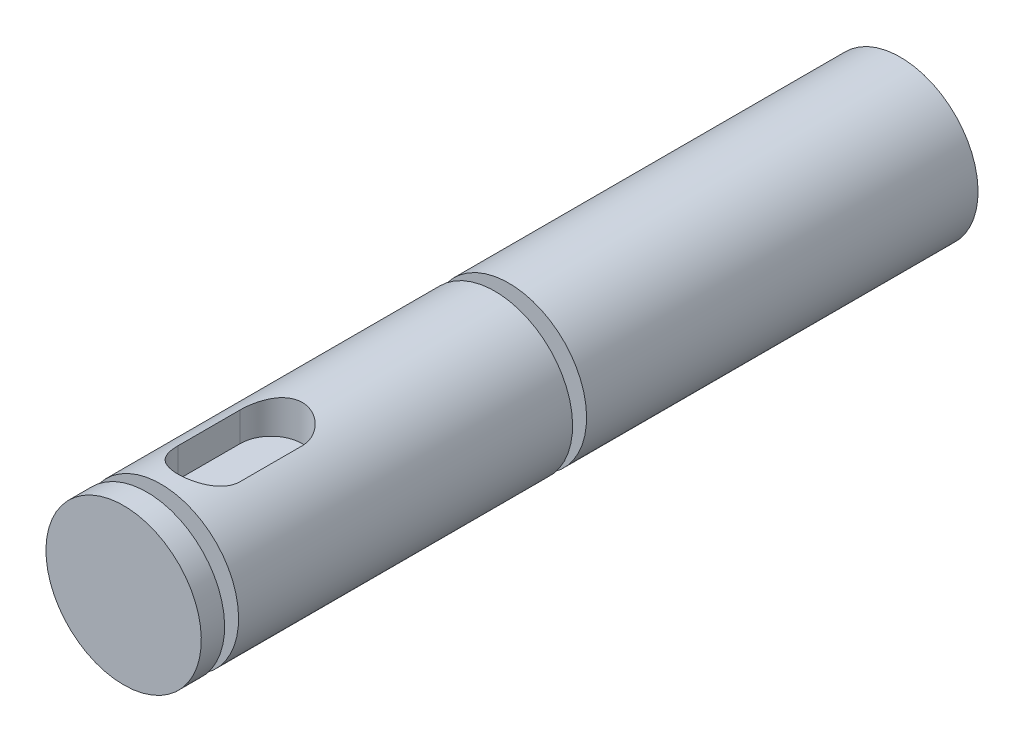
ISO-10303-21;
HEADER;
FILE_DESCRIPTION(('STEP AP214'),'2;1');
FILE_NAME('part.step','',(''),(''),'','','');
FILE_SCHEMA(('AUTOMOTIVE_DESIGN { 1 0 10303 214 1 1 1 1 }'));
ENDSEC;
DATA;
#1=APPLICATION_CONTEXT('core data for automotive mechanical design processes');
#2=APPLICATION_PROTOCOL_DEFINITION('international standard','automotive_design',2000,#1);
#3=PRODUCT_CONTEXT('',#1,'mechanical');
#4=PRODUCT('Part','Part','',(#3));
#5=PRODUCT_RELATED_PRODUCT_CATEGORY('part','',(#4));
#6=PRODUCT_DEFINITION_FORMATION('','',#4);
#7=PRODUCT_DEFINITION_CONTEXT('part definition',#1,'design');
#8=PRODUCT_DEFINITION('design','',#6,#7);
#9=PRODUCT_DEFINITION_SHAPE('','',#8);
#10=(LENGTH_UNIT() NAMED_UNIT(*) SI_UNIT(.MILLI.,.METRE.));
#11=(NAMED_UNIT(*) PLANE_ANGLE_UNIT() SI_UNIT($,.RADIAN.));
#12=(NAMED_UNIT(*) SI_UNIT($,.STERADIAN.) SOLID_ANGLE_UNIT());
#13=UNCERTAINTY_MEASURE_WITH_UNIT(LENGTH_MEASURE(1.E-05),#10,'distance_accuracy_value','');
#14=(GEOMETRIC_REPRESENTATION_CONTEXT(3) GLOBAL_UNCERTAINTY_ASSIGNED_CONTEXT((#13)) GLOBAL_UNIT_ASSIGNED_CONTEXT((#10,
#11,#12)) REPRESENTATION_CONTEXT('',''));
#15=CARTESIAN_POINT('',(0.,0.,0.));
#16=DIRECTION('',(0.,0.,1.));
#17=DIRECTION('',(1.,0.,0.));
#18=AXIS2_PLACEMENT_3D('',#15,#16,#17);
#19=CARTESIAN_POINT('',(0.,0.,0.));
#20=DIRECTION('',(0.,0.,1.));
#21=DIRECTION('',(0.,-1.,0.));
#22=AXIS2_PLACEMENT_3D('',#19,#20,#21);
#23=PLANE('',#22);
#24=CARTESIAN_POINT('',(0.,0.,0.));
#25=DIRECTION('',(0.,0.,1.));
#26=DIRECTION('',(0.,-1.,0.));
#27=AXIS2_PLACEMENT_3D('',#24,#25,#26);
#28=CIRCLE('',#27,5.00000000000002);
#29=CARTESIAN_POINT('',(0.,-5.00000000000002,0.));
#30=VERTEX_POINT('',#29);
#31=EDGE_CURVE('E20',#30,#30,#28,.F.);
#32=ORIENTED_EDGE('',*,*,#31,.F.);
#33=EDGE_LOOP('',(#32));
#34=FACE_BOUND('',#33,.T.);
#35=ADVANCED_FACE('F17',(#34),#23,.T.);
#36=CARTESIAN_POINT('',(0.,0.,-0.750000000000002));
#37=DIRECTION('',(0.,0.,1.));
#38=DIRECTION('',(0.,-1.,0.));
#39=AXIS2_PLACEMENT_3D('',#36,#37,#38);
#40=CYLINDRICAL_SURFACE('',#39,5.00000000000002);
#41=CARTESIAN_POINT('',(0.,0.,-1.50000000000001));
#42=DIRECTION('',(0.,0.,1.));
#43=DIRECTION('',(0.,-1.,0.));
#44=AXIS2_PLACEMENT_3D('',#41,#42,#43);
#45=CIRCLE('',#44,5.00000000000002);
#46=CARTESIAN_POINT('',(0.,-5.00000000000002,-1.50000000000001));
#47=VERTEX_POINT('',#46);
#48=EDGE_CURVE('E172',#47,#47,#45,.F.);
#49=ORIENTED_EDGE('',*,*,#48,.F.);
#50=EDGE_LOOP('',(#49));
#51=FACE_BOUND('',#50,.T.);
#52=ORIENTED_EDGE('',*,*,#31,.T.);
#53=EDGE_LOOP('',(#52));
#54=FACE_BOUND('',#53,.T.);
#55=ADVANCED_FACE('F179',(#51,#54),#40,.T.);
#56=CARTESIAN_POINT('',(0.,5.00000000000001,-1.5));
#57=DIRECTION('',(0.,0.,-1.));
#58=DIRECTION('',(0.,1.,0.));
#59=AXIS2_PLACEMENT_3D('',#56,#57,#58);
#60=PLANE('',#59);
#61=CARTESIAN_POINT('',(0.,0.,-1.50000000000001));
#62=DIRECTION('',(0.,0.,1.));
#63=DIRECTION('',(0.,-1.,0.));
#64=AXIS2_PLACEMENT_3D('',#61,#62,#63);
#65=CIRCLE('',#64,3.55000000000002);
#66=CARTESIAN_POINT('',(0.,-3.55000000000002,-1.50000000000001));
#67=VERTEX_POINT('',#66);
#68=EDGE_CURVE('E170',#67,#67,#65,.F.);
#69=ORIENTED_EDGE('',*,*,#68,.F.);
#70=EDGE_LOOP('',(#69));
#71=FACE_BOUND('',#70,.T.);
#72=ORIENTED_EDGE('',*,*,#48,.T.);
#73=EDGE_LOOP('',(#72));
#74=FACE_BOUND('',#73,.T.);
#75=ADVANCED_FACE('F185',(#71,#74),#60,.T.);
#76=CARTESIAN_POINT('',(0.,0.,-1.95));
#77=DIRECTION('',(0.,0.,1.));
#78=DIRECTION('',(0.,-1.,0.));
#79=AXIS2_PLACEMENT_3D('',#76,#77,#78);
#80=CYLINDRICAL_SURFACE('',#79,3.55000000000002);
#81=CARTESIAN_POINT('',(0.,0.,-2.4));
#82=DIRECTION('',(0.,0.,1.));
#83=DIRECTION('',(0.,-1.,0.));
#84=AXIS2_PLACEMENT_3D('',#81,#82,#83);
#85=CIRCLE('',#84,3.55000000000002);
#86=CARTESIAN_POINT('',(0.,-3.55000000000002,-2.4));
#87=VERTEX_POINT('',#86);
#88=EDGE_CURVE('E73',#87,#87,#85,.F.);
#89=ORIENTED_EDGE('',*,*,#88,.F.);
#90=EDGE_LOOP('',(#89));
#91=FACE_BOUND('',#90,.T.);
#92=ORIENTED_EDGE('',*,*,#68,.T.);
#93=EDGE_LOOP('',(#92));
#94=FACE_BOUND('',#93,.T.);
#95=ADVANCED_FACE('F190',(#91,#94),#80,.T.);
#96=CARTESIAN_POINT('',(0.,2.7,-7.5));
#97=DIRECTION('',(0.,1.,0.));
#98=DIRECTION('',(0.,0.,1.));
#99=AXIS2_PLACEMENT_3D('',#96,#97,#98);
#100=PLANE('',#99);
#101=CARTESIAN_POINT('',(0.,2.7,-5.5));
#102=DIRECTION('',(0.,-1.,0.));
#103=DIRECTION('',(0.,0.,-1.));
#104=AXIS2_PLACEMENT_3D('',#101,#102,#103);
#105=CIRCLE('',#104,2.);
#106=CARTESIAN_POINT('',(-2.,2.7,-5.5));
#107=VERTEX_POINT('',#106);
#108=CARTESIAN_POINT('',(2.,2.7,-5.5));
#109=VERTEX_POINT('',#108);
#110=EDGE_CURVE('E59',#107,#109,#105,.F.);
#111=ORIENTED_EDGE('',*,*,#110,.T.);
#112=DIRECTION('',(0.,0.,-1.));
#113=VECTOR('',#112,1.);
#114=CARTESIAN_POINT('',(2.,2.7,-9.5));
#115=LINE('',#114,#113);
#116=CARTESIAN_POINT('',(2.,2.7,-9.5));
#117=VERTEX_POINT('',#116);
#118=EDGE_CURVE('E85',#109,#117,#115,.T.);
#119=ORIENTED_EDGE('',*,*,#118,.T.);
#120=CARTESIAN_POINT('',(0.,2.7,-9.5));
#121=DIRECTION('',(0.,-1.,0.));
#122=DIRECTION('',(0.,0.,-1.));
#123=AXIS2_PLACEMENT_3D('',#120,#121,#122);
#124=CIRCLE('',#123,2.);
#125=CARTESIAN_POINT('',(-2.,2.7,-9.5));
#126=VERTEX_POINT('',#125);
#127=EDGE_CURVE('E61',#117,#126,#124,.F.);
#128=ORIENTED_EDGE('',*,*,#127,.T.);
#129=DIRECTION('',(0.,0.,1.));
#130=VECTOR('',#129,1.);
#131=CARTESIAN_POINT('',(-2.,2.7,-5.5));
#132=LINE('',#131,#130);
#133=EDGE_CURVE('E56',#126,#107,#132,.T.);
#134=ORIENTED_EDGE('',*,*,#133,.T.);
#135=EDGE_LOOP('',(#111,#119,#128,#134));
#136=FACE_BOUND('',#135,.T.);
#137=ADVANCED_FACE('F58',(#136),#100,.T.);
#138=CARTESIAN_POINT('',(0.,3.55000000000002,-2.4));
#139=DIRECTION('',(0.,0.,1.));
#140=DIRECTION('',(0.,-1.,0.));
#141=AXIS2_PLACEMENT_3D('',#138,#139,#140);
#142=PLANE('',#141);
#143=ORIENTED_EDGE('',*,*,#88,.T.);
#144=EDGE_LOOP('',(#143));
#145=FACE_BOUND('',#144,.T.);
#146=CARTESIAN_POINT('',(0.,0.,-2.4));
#147=DIRECTION('',(0.,0.,1.));
#148=DIRECTION('',(0.,-1.,0.));
#149=AXIS2_PLACEMENT_3D('',#146,#147,#148);
#150=CIRCLE('',#149,5.);
#151=CARTESIAN_POINT('',(0.,-5.,-2.4));
#152=VERTEX_POINT('',#151);
#153=EDGE_CURVE('E164',#152,#152,#150,.F.);
#154=ORIENTED_EDGE('',*,*,#153,.F.);
#155=EDGE_LOOP('',(#154));
#156=FACE_BOUND('',#155,.T.);
#157=ADVANCED_FACE('F199',(#145,#156),#142,.T.);
#158=CARTESIAN_POINT('',(0.,5.,-5.5));
#159=DIRECTION('',(0.,-1.,0.));
#160=DIRECTION('',(0.,0.,-1.));
#161=AXIS2_PLACEMENT_3D('',#158,#159,#160);
#162=CYLINDRICAL_SURFACE('',#161,2.);
#163=DIRECTION('',(0.,1.,0.));
#164=VECTOR('',#163,1.);
#165=CARTESIAN_POINT('',(2.,5.,-5.5));
#166=LINE('',#165,#164);
#167=CARTESIAN_POINT('',(2.,4.58257569495584,-5.5));
#168=VERTEX_POINT('',#167);
#169=EDGE_CURVE('E71',#168,#109,#166,.F.);
#170=ORIENTED_EDGE('',*,*,#169,.T.);
#171=ORIENTED_EDGE('',*,*,#110,.F.);
#172=DIRECTION('',(0.,1.,0.));
#173=VECTOR('',#172,1.);
#174=CARTESIAN_POINT('',(-2.,5.,-5.5));
#175=LINE('',#174,#173);
#176=CARTESIAN_POINT('',(-2.,4.58257569495584,-5.5));
#177=VERTEX_POINT('',#176);
#178=EDGE_CURVE('E65',#107,#177,#175,.T.);
#179=ORIENTED_EDGE('',*,*,#178,.T.);
#180=CARTESIAN_POINT('',(2.,4.58257569495584,-5.5));
#181=CARTESIAN_POINT('',(2.00000798036347,4.58256464470382,-5.44619414749741));
#182=CARTESIAN_POINT('',(1.99782891366025,4.58352306077323,-5.39239433444235));
#183=CARTESIAN_POINT('',(1.98915905973447,4.58729625417544,-5.2852287017453));
#184=CARTESIAN_POINT('',(1.98266991468793,4.59011032448545,-5.23186272464397));
#185=CARTESIAN_POINT('',(1.9654760367637,4.5974978292064,-5.12615317844121));
#186=CARTESIAN_POINT('',(1.95478796820434,4.60206430717533,-5.07380641595597));
#187=CARTESIAN_POINT('',(1.9293163019066,4.61280053296682,-4.97029922828554));
#188=CARTESIAN_POINT('',(1.9145324541709,4.61897037865399,-4.91913887572283));
#189=CARTESIAN_POINT('',(1.86426971793523,4.63959291248422,-4.76806414941803));
#190=CARTESIAN_POINT('',(1.82284489460008,4.65617449157431,-4.67034576931025));
#191=CARTESIAN_POINT('',(1.72548191592176,4.6931237076538,-4.48320441991737));
#192=CARTESIAN_POINT('',(1.66952996336925,4.71349493864007,-4.39378944703834));
#193=CARTESIAN_POINT('',(1.54131835736854,4.75700999402115,-4.22073760332578));
#194=CARTESIAN_POINT('',(1.4683691399273,4.78024245635517,-4.13763278307977));
#195=CARTESIAN_POINT('',(1.30969646176209,4.82612790548656,-3.98445972778927));
#196=CARTESIAN_POINT('',(1.22397038499682,4.84878077249721,-3.91439416913425));
#197=CARTESIAN_POINT('',(1.03800590808969,4.89203417106082,-3.78659360580435));
#198=CARTESIAN_POINT('',(0.937327933050961,4.91251824543531,-3.72945519073807));
#199=CARTESIAN_POINT('',(0.72682414324671,4.94803944125004,-3.63315592731135));
#200=CARTESIAN_POINT('',(0.617002169026244,4.96307883544185,-3.59398757594832));
#201=CARTESIAN_POINT('',(0.396967441295691,4.98538314653816,-3.53665879868942));
#202=CARTESIAN_POINT('',(0.287031054523059,4.99298922547927,-3.51757304909434));
#203=CARTESIAN_POINT('',(0.0652684304565152,5.00080310201086,-3.49797152005438));
#204=CARTESIAN_POINT('',(-0.0465571232841652,5.0010135205303,-3.49744916197646));
#205=CARTESIAN_POINT('',(-0.262233376226784,4.99421960045302,-3.51448283915986));
#206=CARTESIAN_POINT('',(-0.366179202506791,4.98761985585461,-3.531025046674));
#207=CARTESIAN_POINT('',(-0.569674786500929,4.96849270441446,-3.57999342705353));
#208=CARTESIAN_POINT('',(-0.669224295072842,4.95596496209929,-3.61242049886861));
#209=CARTESIAN_POINT('',(-0.862897539070295,4.92596830598785,-3.69263629642451));
#210=CARTESIAN_POINT('',(-0.95691685136644,4.90842774755848,-3.74064924081046));
#211=CARTESIAN_POINT('',(-1.13580746919776,4.87014602008043,-3.85046458859515));
#212=CARTESIAN_POINT('',(-1.22067554984698,4.84940372896449,-3.91227182969058));
#213=CARTESIAN_POINT('',(-1.38476339273627,4.80521782746144,-4.05264418025852));
#214=CARTESIAN_POINT('',(-1.4632477030894,4.78168627172885,-4.13204247467003));
#215=CARTESIAN_POINT('',(-1.60609926099478,4.7356195058465,-4.30298009514766));
#216=CARTESIAN_POINT('',(-1.67046007709005,4.71308475332783,-4.39452492209426));
#217=CARTESIAN_POINT('',(-1.78493657933605,4.67095688856025,-4.59047028402121));
#218=CARTESIAN_POINT('',(-1.83458932217622,4.65146702150583,-4.69516483666021));
#219=CARTESIAN_POINT('',(-1.91521298357264,4.61886105059582,-4.91236152442947));
#220=CARTESIAN_POINT('',(-1.94621696002208,4.60573367628738,-5.02484944733829));
#221=CARTESIAN_POINT('',(-1.9781058182572,4.59208303529493,-5.19874363415798));
#222=CARTESIAN_POINT('',(-1.98630505165979,4.58853437680527,-5.25865754930133));
#223=CARTESIAN_POINT('',(-1.99725282103812,4.58377540314389,-5.37903501899554));
#224=CARTESIAN_POINT('',(-2.00000471568568,4.58256364711745,-5.43949821175783));
#225=CARTESIAN_POINT('',(-2.,4.58257569495584,-5.5));
#226=B_SPLINE_CURVE_WITH_KNOTS('',3,(#180,#181,#182,#183,#184,#185,#186,#187,#188,#189,#190,
#191,#192,#193,#194,#195,#196,#197,#198,#199,#200,#201,#202,#203,#204,#205,#206,#207,#208,#209,
#210,#211,#212,#213,#214,#215,#216,#217,#218,#219,#220,#221,#222,#223,#224,#225),.UNSPECIFIED.,
.F.,.F.,(4,2,2,2,2,2,2,2,2,2,2,2,2,2,2,2,2,2,2,2,2,2,4),(0.,0.161354853098824,0.322648263883208,
0.483307911251882,0.643977367092306,0.964683001739095,1.28569434942626,1.62318047995498,
1.96073580539191,2.31162858925764,2.66237473197323,2.9961387650427,3.32978451514656,
3.64468915259535,3.95961161305654,4.27928176927547,4.59906421133019,4.93981874675153,
5.28072813203934,5.63144241548462,5.98153315592125,6.16300192557813,6.3443587719356),.UNSPECIFIED.);
#227=EDGE_CURVE('E107',#168,#177,#226,.T.);
#228=ORIENTED_EDGE('',*,*,#227,.F.);
#229=EDGE_LOOP('',(#170,#171,#179,#228));
#230=FACE_BOUND('',#229,.T.);
#231=ADVANCED_FACE('F68',(#230),#162,.F.);
#232=CARTESIAN_POINT('',(-2.,5.,-5.5));
#233=DIRECTION('',(-1.,0.,0.));
#234=DIRECTION('',(0.,0.,1.));
#235=AXIS2_PLACEMENT_3D('',#232,#233,#234);
#236=PLANE('',#235);
#237=ORIENTED_EDGE('',*,*,#178,.F.);
#238=ORIENTED_EDGE('',*,*,#133,.F.);
#239=DIRECTION('',(0.,-1.,0.));
#240=VECTOR('',#239,1.);
#241=CARTESIAN_POINT('',(-2.,5.,-9.5));
#242=LINE('',#241,#240);
#243=CARTESIAN_POINT('',(-2.,4.58257569495585,-9.5));
#244=VERTEX_POINT('',#243);
#245=EDGE_CURVE('E80',#126,#244,#242,.F.);
#246=ORIENTED_EDGE('',*,*,#245,.T.);
#247=DIRECTION('',(0.,0.,1.));
#248=VECTOR('',#247,1.);
#249=CARTESIAN_POINT('',(-2.,4.58257569495585,-13.15));
#250=LINE('',#249,#248);
#251=EDGE_CURVE('E77',#177,#244,#250,.F.);
#252=ORIENTED_EDGE('',*,*,#251,.F.);
#253=EDGE_LOOP('',(#237,#238,#246,#252));
#254=FACE_BOUND('',#253,.T.);
#255=ADVANCED_FACE('F75',(#254),#236,.F.);
#256=CARTESIAN_POINT('',(0.,5.,-9.5));
#257=DIRECTION('',(0.,-1.,0.));
#258=DIRECTION('',(0.,0.,-1.));
#259=AXIS2_PLACEMENT_3D('',#256,#257,#258);
#260=CYLINDRICAL_SURFACE('',#259,2.);
#261=ORIENTED_EDGE('',*,*,#245,.F.);
#262=ORIENTED_EDGE('',*,*,#127,.F.);
#263=DIRECTION('',(0.,1.,0.));
#264=VECTOR('',#263,1.);
#265=CARTESIAN_POINT('',(2.,5.,-9.5));
#266=LINE('',#265,#264);
#267=CARTESIAN_POINT('',(2.,4.58257569495585,-9.5));
#268=VERTEX_POINT('',#267);
#269=EDGE_CURVE('E35',#117,#268,#266,.T.);
#270=ORIENTED_EDGE('',*,*,#269,.T.);
#271=CARTESIAN_POINT('',(-2.,4.58257569495585,-9.5));
#272=CARTESIAN_POINT('',(-2.00000798036347,4.58256464470382,-9.55380585250259));
#273=CARTESIAN_POINT('',(-1.99782891366025,4.58352306077323,-9.60760566555765));
#274=CARTESIAN_POINT('',(-1.98915905973447,4.58729625417544,-9.7147712982547));
#275=CARTESIAN_POINT('',(-1.98266991468793,4.59011032448546,-9.76813727535603));
#276=CARTESIAN_POINT('',(-1.9654760367637,4.5974978292064,-9.87384682155879));
#277=CARTESIAN_POINT('',(-1.95478796820434,4.60206430717533,-9.92619358404403));
#278=CARTESIAN_POINT('',(-1.9293163019066,4.61280053296683,-10.0297007717145));
#279=CARTESIAN_POINT('',(-1.9145324541709,4.61897037865399,-10.0808611242772));
#280=CARTESIAN_POINT('',(-1.86426971793523,4.63959291248422,-10.231935850582));
#281=CARTESIAN_POINT('',(-1.82284489460008,4.65617449157431,-10.3296542306897));
#282=CARTESIAN_POINT('',(-1.72548191592176,4.69312370765381,-10.5167955800826));
#283=CARTESIAN_POINT('',(-1.66952996336925,4.71349493864008,-10.6062105529617));
#284=CARTESIAN_POINT('',(-1.54131835736854,4.75700999402115,-10.7792623966742));
#285=CARTESIAN_POINT('',(-1.4683691399273,4.78024245635517,-10.8623672169202));
#286=CARTESIAN_POINT('',(-1.30969646176209,4.82612790548656,-11.0155402722107));
#287=CARTESIAN_POINT('',(-1.22397038499682,4.84878077249722,-11.0856058308657));
#288=CARTESIAN_POINT('',(-1.03800590808969,4.89203417106083,-11.2134063941957));
#289=CARTESIAN_POINT('',(-0.937327933050961,4.91251824543532,-11.2705448092619));
#290=CARTESIAN_POINT('',(-0.726824143246709,4.94803944125005,-11.3668440726886));
#291=CARTESIAN_POINT('',(-0.617002169026243,4.96307883544186,-11.4060124240517));
#292=CARTESIAN_POINT('',(-0.39696744129569,4.98538314653816,-11.4633412013106));
#293=CARTESIAN_POINT('',(-0.287031054523058,4.99298922547928,-11.4824269509057));
#294=CARTESIAN_POINT('',(-0.0652684304565142,5.00080310201086,-11.5020284799456));
#295=CARTESIAN_POINT('',(0.0465571232841663,5.0010135205303,-11.5025508380235));
#296=CARTESIAN_POINT('',(0.262233376226785,4.99421960045303,-11.4855171608401));
#297=CARTESIAN_POINT('',(0.366179202506792,4.98761985585462,-11.468974953326));
#298=CARTESIAN_POINT('',(0.56967478650093,4.96849270441447,-11.4200065729465));
#299=CARTESIAN_POINT('',(0.669224295072843,4.9559649620993,-11.3875795011314));
#300=CARTESIAN_POINT('',(0.862897539070296,4.92596830598786,-11.3073637035755));
#301=CARTESIAN_POINT('',(0.95691685136644,4.90842774755849,-11.2593507591895));
#302=CARTESIAN_POINT('',(1.13580746919776,4.87014602008044,-11.1495354114048));
#303=CARTESIAN_POINT('',(1.22067554984698,4.84940372896449,-11.0877281703094));
#304=CARTESIAN_POINT('',(1.38476339273627,4.80521782746144,-10.9473558197415));
#305=CARTESIAN_POINT('',(1.4632477030894,4.78168627172885,-10.86795752533));
#306=CARTESIAN_POINT('',(1.60609926099478,4.73561950584651,-10.6970199048523));
#307=CARTESIAN_POINT('',(1.67046007709005,4.71308475332784,-10.6054750779057));
#308=CARTESIAN_POINT('',(1.78493657933605,4.67095688856025,-10.4095297159788));
#309=CARTESIAN_POINT('',(1.83458932217622,4.65146702150584,-10.3048351633398));
#310=CARTESIAN_POINT('',(1.91521298357264,4.61886105059582,-10.0876384755705));
#311=CARTESIAN_POINT('',(1.94621696002208,4.60573367628738,-9.9751505526617));
#312=CARTESIAN_POINT('',(1.9781058182572,4.59208303529493,-9.80125636584202));
#313=CARTESIAN_POINT('',(1.98630505165979,4.58853437680527,-9.74134245069867));
#314=CARTESIAN_POINT('',(1.99725282103812,4.58377540314389,-9.62096498100446));
#315=CARTESIAN_POINT('',(2.00000471568568,4.58256364711745,-9.56050178824217));
#316=CARTESIAN_POINT('',(2.,4.58257569495585,-9.5));
#317=B_SPLINE_CURVE_WITH_KNOTS('',3,(#271,#272,#273,#274,#275,#276,#277,#278,#279,#280,#281,
#282,#283,#284,#285,#286,#287,#288,#289,#290,#291,#292,#293,#294,#295,#296,#297,#298,#299,#300,
#301,#302,#303,#304,#305,#306,#307,#308,#309,#310,#311,#312,#313,#314,#315,#316),.UNSPECIFIED.,
.F.,.F.,(4,2,2,2,2,2,2,2,2,2,2,2,2,2,2,2,2,2,2,2,2,2,4),(0.,0.161354853098824,0.322648263883208,
0.483307911251882,0.643977367092306,0.964683001739093,1.28569434942626,1.62318047995498,
1.96073580539191,2.31162858925764,2.66237473197323,2.9961387650427,3.32978451514656,
3.64468915259535,3.95961161305654,4.27928176927547,4.59906421133019,4.93981874675153,
5.28072813203934,5.63144241548462,5.98153315592125,6.16300192557814,6.34435877193561),.UNSPECIFIED.);
#318=EDGE_CURVE('E99',#244,#268,#317,.T.);
#319=ORIENTED_EDGE('',*,*,#318,.F.);
#320=EDGE_LOOP('',(#261,#262,#270,#319));
#321=FACE_BOUND('',#320,.T.);
#322=ADVANCED_FACE('F113',(#321),#260,.F.);
#323=CARTESIAN_POINT('',(2.,5.,-9.5));
#324=DIRECTION('',(1.,0.,0.));
#325=DIRECTION('',(0.,0.,-1.));
#326=AXIS2_PLACEMENT_3D('',#323,#324,#325);
#327=PLANE('',#326);
#328=ORIENTED_EDGE('',*,*,#269,.F.);
#329=ORIENTED_EDGE('',*,*,#118,.F.);
#330=ORIENTED_EDGE('',*,*,#169,.F.);
#331=DIRECTION('',(0.,0.,1.));
#332=VECTOR('',#331,1.);
#333=CARTESIAN_POINT('',(2.,4.58257569495585,-13.15));
#334=LINE('',#333,#332);
#335=EDGE_CURVE('E98',#268,#168,#334,.T.);
#336=ORIENTED_EDGE('',*,*,#335,.F.);
#337=EDGE_LOOP('',(#328,#329,#330,#336));
#338=FACE_BOUND('',#337,.T.);
#339=ADVANCED_FACE('F122',(#338),#327,.F.);
#340=CARTESIAN_POINT('',(0.,0.,-13.15));
#341=DIRECTION('',(0.,0.,1.));
#342=DIRECTION('',(0.,-1.,0.));
#343=AXIS2_PLACEMENT_3D('',#340,#341,#342);
#344=CYLINDRICAL_SURFACE('',#343,5.);
#345=CARTESIAN_POINT('',(0.,0.,-23.9));
#346=DIRECTION('',(0.,0.,1.));
#347=DIRECTION('',(0.,-1.,0.));
#348=AXIS2_PLACEMENT_3D('',#345,#346,#347);
#349=CIRCLE('',#348,5.);
#350=CARTESIAN_POINT('',(0.,-4.99999999999998,-23.9));
#351=VERTEX_POINT('',#350);
#352=EDGE_CURVE('E95',#351,#351,#349,.F.);
#353=ORIENTED_EDGE('',*,*,#352,.F.);
#354=EDGE_LOOP('',(#353));
#355=FACE_BOUND('',#354,.T.);
#356=ORIENTED_EDGE('',*,*,#318,.T.);
#357=ORIENTED_EDGE('',*,*,#335,.T.);
#358=ORIENTED_EDGE('',*,*,#227,.T.);
#359=ORIENTED_EDGE('',*,*,#251,.T.);
#360=EDGE_LOOP('',(#356,#357,#358,#359));
#361=FACE_BOUND('',#360,.T.);
#362=ORIENTED_EDGE('',*,*,#153,.T.);
#363=EDGE_LOOP('',(#362));
#364=FACE_BOUND('',#363,.T.);
#365=ADVANCED_FACE('F117',(#355,#361,#364),#344,.T.);
#366=CARTESIAN_POINT('',(0.,5.00000000000002,-23.9));
#367=DIRECTION('',(0.,0.,-1.));
#368=DIRECTION('',(0.,1.,0.));
#369=AXIS2_PLACEMENT_3D('',#366,#367,#368);
#370=PLANE('',#369);
#371=CARTESIAN_POINT('',(0.,0.,-23.9));
#372=DIRECTION('',(0.,0.,1.));
#373=DIRECTION('',(0.,-1.,0.));
#374=AXIS2_PLACEMENT_3D('',#371,#372,#373);
#375=CIRCLE('',#374,3.55000000000001);
#376=CARTESIAN_POINT('',(0.,-3.54999999999999,-23.9));
#377=VERTEX_POINT('',#376);
#378=EDGE_CURVE('E92',#377,#377,#375,.F.);
#379=ORIENTED_EDGE('',*,*,#378,.F.);
#380=EDGE_LOOP('',(#379));
#381=FACE_BOUND('',#380,.T.);
#382=ORIENTED_EDGE('',*,*,#352,.T.);
#383=EDGE_LOOP('',(#382));
#384=FACE_BOUND('',#383,.T.);
#385=ADVANCED_FACE('F121',(#381,#384),#370,.T.);
#386=CARTESIAN_POINT('',(0.,0.,-24.35));
#387=DIRECTION('',(0.,0.,1.));
#388=DIRECTION('',(0.,-1.,0.));
#389=AXIS2_PLACEMENT_3D('',#386,#387,#388);
#390=CYLINDRICAL_SURFACE('',#389,3.55000000000001);
#391=CARTESIAN_POINT('',(0.,0.,-24.8));
#392=DIRECTION('',(0.,0.,1.));
#393=DIRECTION('',(0.,-1.,0.));
#394=AXIS2_PLACEMENT_3D('',#391,#392,#393);
#395=CIRCLE('',#394,3.55000000000001);
#396=CARTESIAN_POINT('',(0.,-3.54999999999999,-24.8));
#397=VERTEX_POINT('',#396);
#398=EDGE_CURVE('E89',#397,#397,#395,.F.);
#399=ORIENTED_EDGE('',*,*,#398,.F.);
#400=EDGE_LOOP('',(#399));
#401=FACE_BOUND('',#400,.T.);
#402=ORIENTED_EDGE('',*,*,#378,.T.);
#403=EDGE_LOOP('',(#402));
#404=FACE_BOUND('',#403,.T.);
#405=ADVANCED_FACE('F146',(#401,#404),#390,.T.);
#406=CARTESIAN_POINT('',(0.,3.55000000000002,-24.8));
#407=DIRECTION('',(0.,0.,1.));
#408=DIRECTION('',(0.,-1.,0.));
#409=AXIS2_PLACEMENT_3D('',#406,#407,#408);
#410=PLANE('',#409);
#411=ORIENTED_EDGE('',*,*,#398,.T.);
#412=EDGE_LOOP('',(#411));
#413=FACE_BOUND('',#412,.T.);
#414=CARTESIAN_POINT('',(0.,0.,-24.8));
#415=DIRECTION('',(0.,0.,1.));
#416=DIRECTION('',(0.,-1.,0.));
#417=AXIS2_PLACEMENT_3D('',#414,#415,#416);
#418=CIRCLE('',#417,5.);
#419=CARTESIAN_POINT('',(0.,-4.99999999999998,-24.8));
#420=VERTEX_POINT('',#419);
#421=EDGE_CURVE('E26',#420,#420,#418,.F.);
#422=ORIENTED_EDGE('',*,*,#421,.F.);
#423=EDGE_LOOP('',(#422));
#424=FACE_BOUND('',#423,.T.);
#425=ADVANCED_FACE('F140',(#413,#424),#410,.T.);
#426=CARTESIAN_POINT('',(0.,5.00000000000003,-50.));
#427=DIRECTION('',(0.,0.,-1.));
#428=DIRECTION('',(0.,1.,0.));
#429=AXIS2_PLACEMENT_3D('',#426,#427,#428);
#430=PLANE('',#429);
#431=CARTESIAN_POINT('',(0.,0.,-50.));
#432=DIRECTION('',(0.,0.,1.));
#433=DIRECTION('',(0.,-1.,0.));
#434=AXIS2_PLACEMENT_3D('',#431,#432,#433);
#435=CIRCLE('',#434,5.);
#436=CARTESIAN_POINT('',(0.,-4.99999999999997,-50.));
#437=VERTEX_POINT('',#436);
#438=EDGE_CURVE('E11',#437,#437,#435,.T.);
#439=ORIENTED_EDGE('',*,*,#438,.F.);
#440=EDGE_LOOP('',(#439));
#441=FACE_BOUND('',#440,.T.);
#442=ADVANCED_FACE('F134',(#441),#430,.T.);
#443=CARTESIAN_POINT('',(0.,0.,-37.4));
#444=DIRECTION('',(0.,0.,1.));
#445=DIRECTION('',(0.,-1.,0.));
#446=AXIS2_PLACEMENT_3D('',#443,#444,#445);
#447=CYLINDRICAL_SURFACE('',#446,5.);
#448=ORIENTED_EDGE('',*,*,#438,.T.);
#449=EDGE_LOOP('',(#448));
#450=FACE_BOUND('',#449,.T.);
#451=ORIENTED_EDGE('',*,*,#421,.T.);
#452=EDGE_LOOP('',(#451));
#453=FACE_BOUND('',#452,.T.);
#454=ADVANCED_FACE('F132',(#450,#453),#447,.T.);
#455=CLOSED_SHELL('',(#35,#55,#75,#95,#137,#157,#231,#255,#322,#339,#365,#385,#405,#425,#442,#454));
#456=MANIFOLD_SOLID_BREP('B1',#455);
#457=ADVANCED_BREP_SHAPE_REPRESENTATION('',(#18,#456),#14);
#458=SHAPE_DEFINITION_REPRESENTATION(#9,#457);
ENDSEC;
END-ISO-10303-21;
